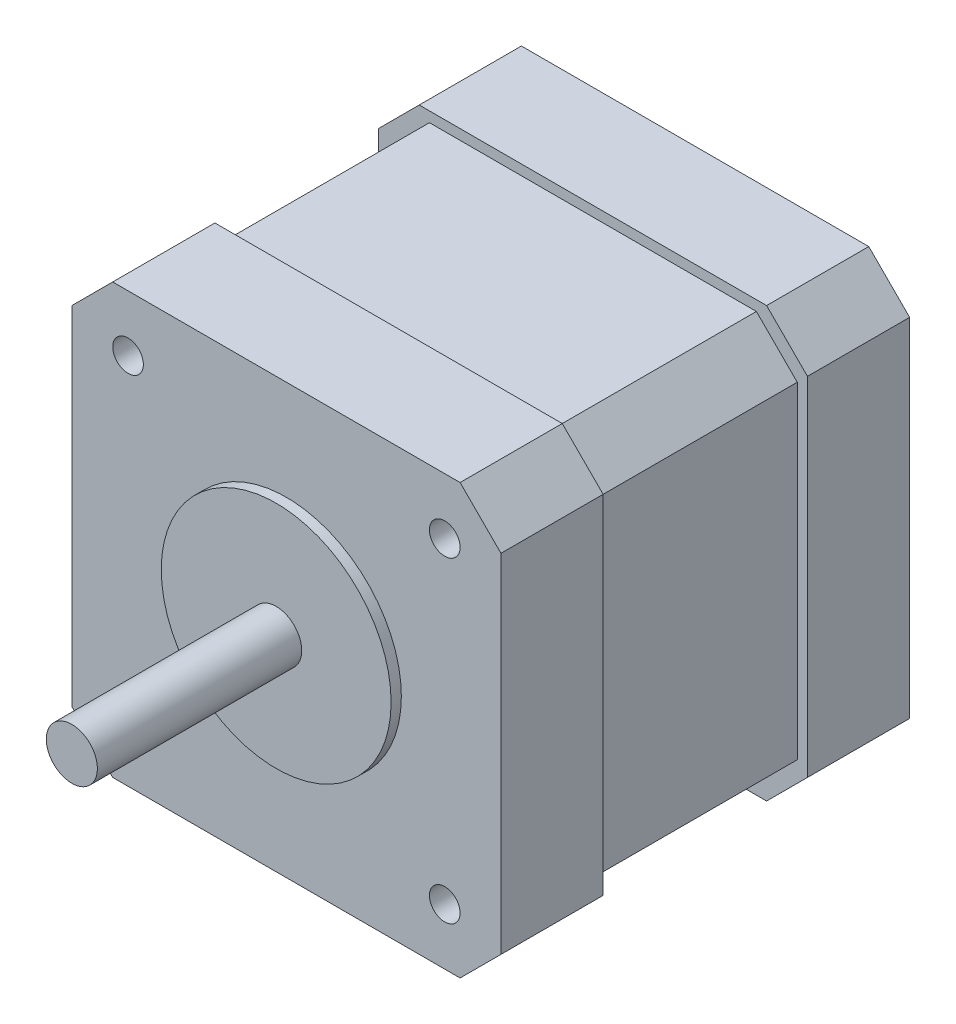
ISO-10303-21;
HEADER;
FILE_DESCRIPTION(('STEP AP214'),'2;1');
FILE_NAME('part.step','',(''),(''),'','','');
FILE_SCHEMA(('AUTOMOTIVE_DESIGN { 1 0 10303 214 1 1 1 1 }'));
ENDSEC;
DATA;
#1=APPLICATION_CONTEXT('core data for automotive mechanical design processes');
#2=APPLICATION_PROTOCOL_DEFINITION('international standard','automotive_design',2000,#1);
#3=PRODUCT_CONTEXT('',#1,'mechanical');
#4=PRODUCT('Part','Part','',(#3));
#5=PRODUCT_RELATED_PRODUCT_CATEGORY('part','',(#4));
#6=PRODUCT_DEFINITION_FORMATION('','',#4);
#7=PRODUCT_DEFINITION_CONTEXT('part definition',#1,'design');
#8=PRODUCT_DEFINITION('design','',#6,#7);
#9=PRODUCT_DEFINITION_SHAPE('','',#8);
#10=(LENGTH_UNIT() NAMED_UNIT(*) SI_UNIT(.MILLI.,.METRE.));
#11=(NAMED_UNIT(*) PLANE_ANGLE_UNIT() SI_UNIT($,.RADIAN.));
#12=(NAMED_UNIT(*) SI_UNIT($,.STERADIAN.) SOLID_ANGLE_UNIT());
#13=UNCERTAINTY_MEASURE_WITH_UNIT(LENGTH_MEASURE(1.E-05),#10,'distance_accuracy_value','');
#14=(GEOMETRIC_REPRESENTATION_CONTEXT(3) GLOBAL_UNCERTAINTY_ASSIGNED_CONTEXT((#13)) GLOBAL_UNIT_ASSIGNED_CONTEXT((#10,
#11,#12)) REPRESENTATION_CONTEXT('',''));
#15=CARTESIAN_POINT('',(0.,0.,0.));
#16=DIRECTION('',(0.,0.,1.));
#17=DIRECTION('',(1.,0.,0.));
#18=AXIS2_PLACEMENT_3D('',#15,#16,#17);
#19=CARTESIAN_POINT('',(0.,0.,10.));
#20=DIRECTION('',(0.,0.,1.));
#21=DIRECTION('',(1.,0.,0.));
#22=AXIS2_PLACEMENT_3D('',#19,#20,#21);
#23=PLANE('',#22);
#24=DIRECTION('',(0.,-1.,0.));
#25=VECTOR('',#24,1.);
#26=CARTESIAN_POINT('',(-21.,21.,10.));
#27=LINE('',#26,#25);
#28=CARTESIAN_POINT('',(-21.,17.,10.));
#29=VERTEX_POINT('',#28);
#30=CARTESIAN_POINT('',(-21.,-17.,10.));
#31=VERTEX_POINT('',#30);
#32=EDGE_CURVE('E286',#29,#31,#27,.T.);
#33=ORIENTED_EDGE('',*,*,#32,.T.);
#34=DIRECTION('',(-0.707106781186546,0.707106781186549,0.));
#35=VECTOR('',#34,1.);
#36=CARTESIAN_POINT('',(-19.,-19.,10.));
#37=LINE('',#36,#35);
#38=CARTESIAN_POINT('',(-17.,-21.,10.));
#39=VERTEX_POINT('',#38);
#40=EDGE_CURVE('E11',#31,#39,#37,.F.);
#41=ORIENTED_EDGE('',*,*,#40,.T.);
#42=DIRECTION('',(1.,0.,0.));
#43=VECTOR('',#42,1.);
#44=CARTESIAN_POINT('',(-21.,-21.,10.));
#45=LINE('',#44,#43);
#46=CARTESIAN_POINT('',(17.,-21.,10.));
#47=VERTEX_POINT('',#46);
#48=EDGE_CURVE('E290',#39,#47,#45,.T.);
#49=ORIENTED_EDGE('',*,*,#48,.T.);
#50=DIRECTION('',(-0.707106781186548,-0.707106781186547,0.));
#51=VECTOR('',#50,1.);
#52=CARTESIAN_POINT('',(19.,-19.,10.));
#53=LINE('',#52,#51);
#54=CARTESIAN_POINT('',(21.,-17.,10.));
#55=VERTEX_POINT('',#54);
#56=EDGE_CURVE('E50',#47,#55,#53,.F.);
#57=ORIENTED_EDGE('',*,*,#56,.T.);
#58=DIRECTION('',(0.,1.,0.));
#59=VECTOR('',#58,1.);
#60=CARTESIAN_POINT('',(21.,21.,10.));
#61=LINE('',#60,#59);
#62=CARTESIAN_POINT('',(21.,17.,10.));
#63=VERTEX_POINT('',#62);
#64=EDGE_CURVE('E279',#55,#63,#61,.T.);
#65=ORIENTED_EDGE('',*,*,#64,.T.);
#66=DIRECTION('',(0.707106781186547,-0.707106781186548,0.));
#67=VECTOR('',#66,1.);
#68=CARTESIAN_POINT('',(19.,19.,10.));
#69=LINE('',#68,#67);
#70=CARTESIAN_POINT('',(17.,21.,10.));
#71=VERTEX_POINT('',#70);
#72=EDGE_CURVE('E64',#63,#71,#69,.F.);
#73=ORIENTED_EDGE('',*,*,#72,.T.);
#74=DIRECTION('',(-1.,0.,0.));
#75=VECTOR('',#74,1.);
#76=CARTESIAN_POINT('',(-21.,21.,10.));
#77=LINE('',#76,#75);
#78=CARTESIAN_POINT('',(-17.,21.,10.));
#79=VERTEX_POINT('',#78);
#80=EDGE_CURVE('E282',#71,#79,#77,.T.);
#81=ORIENTED_EDGE('',*,*,#80,.T.);
#82=DIRECTION('',(0.707106781186548,0.707106781186547,0.));
#83=VECTOR('',#82,1.);
#84=CARTESIAN_POINT('',(-19.,19.,10.));
#85=LINE('',#84,#83);
#86=EDGE_CURVE('E215',#79,#29,#85,.F.);
#87=ORIENTED_EDGE('',*,*,#86,.T.);
#88=EDGE_LOOP('',(#33,#41,#49,#57,#65,#73,#81,#87));
#89=FACE_BOUND('',#88,.T.);
#90=DIRECTION('',(-1.,0.,0.));
#91=VECTOR('',#90,1.);
#92=CARTESIAN_POINT('',(-20.,20.,10.));
#93=LINE('',#92,#91);
#94=CARTESIAN_POINT('',(16.,20.,10.));
#95=VERTEX_POINT('',#94);
#96=CARTESIAN_POINT('',(-16.,20.,10.));
#97=VERTEX_POINT('',#96);
#98=EDGE_CURVE('E268',#95,#97,#93,.T.);
#99=ORIENTED_EDGE('',*,*,#98,.F.);
#100=DIRECTION('',(-0.707106781186546,0.707106781186549,0.));
#101=VECTOR('',#100,1.);
#102=CARTESIAN_POINT('',(16.,20.,10.));
#103=LINE('',#102,#101);
#104=CARTESIAN_POINT('',(20.,16.,10.));
#105=VERTEX_POINT('',#104);
#106=EDGE_CURVE('E419',#95,#105,#103,.F.);
#107=ORIENTED_EDGE('',*,*,#106,.T.);
#108=DIRECTION('',(0.,1.,0.));
#109=VECTOR('',#108,1.);
#110=CARTESIAN_POINT('',(20.,20.,10.));
#111=LINE('',#110,#109);
#112=CARTESIAN_POINT('',(20.,-16.,10.));
#113=VERTEX_POINT('',#112);
#114=EDGE_CURVE('E264',#113,#105,#111,.T.);
#115=ORIENTED_EDGE('',*,*,#114,.F.);
#116=DIRECTION('',(0.707106781186548,0.707106781186547,0.));
#117=VECTOR('',#116,1.);
#118=CARTESIAN_POINT('',(20.,-16.,10.));
#119=LINE('',#118,#117);
#120=CARTESIAN_POINT('',(16.,-20.,10.));
#121=VERTEX_POINT('',#120);
#122=EDGE_CURVE('E413',#113,#121,#119,.F.);
#123=ORIENTED_EDGE('',*,*,#122,.T.);
#124=DIRECTION('',(1.,0.,0.));
#125=VECTOR('',#124,1.);
#126=CARTESIAN_POINT('',(-20.,-20.,10.));
#127=LINE('',#126,#125);
#128=CARTESIAN_POINT('',(-16.,-20.,10.));
#129=VERTEX_POINT('',#128);
#130=EDGE_CURVE('E251',#129,#121,#127,.T.);
#131=ORIENTED_EDGE('',*,*,#130,.F.);
#132=DIRECTION('',(0.707106781186547,-0.707106781186548,0.));
#133=VECTOR('',#132,1.);
#134=CARTESIAN_POINT('',(-16.,-20.,10.));
#135=LINE('',#134,#133);
#136=CARTESIAN_POINT('',(-20.,-16.,10.));
#137=VERTEX_POINT('',#136);
#138=EDGE_CURVE('E407',#129,#137,#135,.F.);
#139=ORIENTED_EDGE('',*,*,#138,.T.);
#140=DIRECTION('',(0.,-1.,0.));
#141=VECTOR('',#140,1.);
#142=CARTESIAN_POINT('',(-20.,20.,10.));
#143=LINE('',#142,#141);
#144=CARTESIAN_POINT('',(-20.,16.,10.));
#145=VERTEX_POINT('',#144);
#146=EDGE_CURVE('E272',#145,#137,#143,.T.);
#147=ORIENTED_EDGE('',*,*,#146,.F.);
#148=DIRECTION('',(-0.707106781186548,-0.707106781186547,0.));
#149=VECTOR('',#148,1.);
#150=CARTESIAN_POINT('',(-20.,16.,10.));
#151=LINE('',#150,#149);
#152=EDGE_CURVE('E425',#145,#97,#151,.F.);
#153=ORIENTED_EDGE('',*,*,#152,.T.);
#154=EDGE_LOOP('',(#99,#107,#115,#123,#131,#139,#147,#153));
#155=FACE_BOUND('',#154,.T.);
#156=ADVANCED_FACE('F41',(#89,#155),#23,.T.);
#157=CARTESIAN_POINT('',(21.,21.,10.));
#158=DIRECTION('',(-1.,0.,0.));
#159=DIRECTION('',(0.,0.,1.));
#160=AXIS2_PLACEMENT_3D('',#157,#158,#159);
#161=PLANE('',#160);
#162=ORIENTED_EDGE('',*,*,#64,.F.);
#163=DIRECTION('',(0.,0.,-1.));
#164=VECTOR('',#163,1.);
#165=CARTESIAN_POINT('',(21.,-17.,10.));
#166=LINE('',#165,#164);
#167=CARTESIAN_POINT('',(21.,-17.,0.));
#168=VERTEX_POINT('',#167);
#169=EDGE_CURVE('E383',#55,#168,#166,.T.);
#170=ORIENTED_EDGE('',*,*,#169,.T.);
#171=DIRECTION('',(0.,1.,0.));
#172=VECTOR('',#171,1.);
#173=CARTESIAN_POINT('',(21.,21.,0.));
#174=LINE('',#173,#172);
#175=CARTESIAN_POINT('',(21.,17.,0.));
#176=VERTEX_POINT('',#175);
#177=EDGE_CURVE('E263',#168,#176,#174,.T.);
#178=ORIENTED_EDGE('',*,*,#177,.T.);
#179=DIRECTION('',(0.,0.,1.));
#180=VECTOR('',#179,1.);
#181=CARTESIAN_POINT('',(21.,17.,10.));
#182=LINE('',#181,#180);
#183=EDGE_CURVE('E380',#176,#63,#182,.T.);
#184=ORIENTED_EDGE('',*,*,#183,.T.);
#185=EDGE_LOOP('',(#162,#170,#178,#184));
#186=FACE_BOUND('',#185,.T.);
#187=ADVANCED_FACE('F451',(#186),#161,.F.);
#188=CARTESIAN_POINT('',(-21.,21.,10.));
#189=DIRECTION('',(0.,-1.,0.));
#190=DIRECTION('',(0.,0.,-1.));
#191=AXIS2_PLACEMENT_3D('',#188,#189,#190);
#192=PLANE('',#191);
#193=ORIENTED_EDGE('',*,*,#80,.F.);
#194=DIRECTION('',(0.,0.,-1.));
#195=VECTOR('',#194,1.);
#196=CARTESIAN_POINT('',(17.,21.,10.));
#197=LINE('',#196,#195);
#198=CARTESIAN_POINT('',(17.,21.,0.));
#199=VERTEX_POINT('',#198);
#200=EDGE_CURVE('E403',#71,#199,#197,.T.);
#201=ORIENTED_EDGE('',*,*,#200,.T.);
#202=DIRECTION('',(-1.,0.,0.));
#203=VECTOR('',#202,1.);
#204=CARTESIAN_POINT('',(-21.,21.,0.));
#205=LINE('',#204,#203);
#206=CARTESIAN_POINT('',(-17.,21.,0.));
#207=VERTEX_POINT('',#206);
#208=EDGE_CURVE('E297',#199,#207,#205,.T.);
#209=ORIENTED_EDGE('',*,*,#208,.T.);
#210=DIRECTION('',(0.,0.,1.));
#211=VECTOR('',#210,1.);
#212=CARTESIAN_POINT('',(-17.,21.,10.));
#213=LINE('',#212,#211);
#214=EDGE_CURVE('E57',#207,#79,#213,.T.);
#215=ORIENTED_EDGE('',*,*,#214,.T.);
#216=EDGE_LOOP('',(#193,#201,#209,#215));
#217=FACE_BOUND('',#216,.T.);
#218=ADVANCED_FACE('F473',(#217),#192,.F.);
#219=CARTESIAN_POINT('',(-21.,21.,10.));
#220=DIRECTION('',(1.,0.,0.));
#221=DIRECTION('',(0.,1.,0.));
#222=AXIS2_PLACEMENT_3D('',#219,#220,#221);
#223=PLANE('',#222);
#224=DIRECTION('',(0.,-1.,0.));
#225=VECTOR('',#224,1.);
#226=CARTESIAN_POINT('',(-21.,21.,0.));
#227=LINE('',#226,#225);
#228=CARTESIAN_POINT('',(-21.,17.,0.));
#229=VERTEX_POINT('',#228);
#230=CARTESIAN_POINT('',(-21.,-17.,0.));
#231=VERTEX_POINT('',#230);
#232=EDGE_CURVE('E300',#229,#231,#227,.T.);
#233=ORIENTED_EDGE('',*,*,#232,.T.);
#234=DIRECTION('',(0.,0.,1.));
#235=VECTOR('',#234,1.);
#236=CARTESIAN_POINT('',(-21.,-17.,10.));
#237=LINE('',#236,#235);
#238=EDGE_CURVE('E363',#231,#31,#237,.T.);
#239=ORIENTED_EDGE('',*,*,#238,.T.);
#240=ORIENTED_EDGE('',*,*,#32,.F.);
#241=DIRECTION('',(0.,0.,-1.));
#242=VECTOR('',#241,1.);
#243=CARTESIAN_POINT('',(-21.,17.,10.));
#244=LINE('',#243,#242);
#245=EDGE_CURVE('E359',#29,#229,#244,.T.);
#246=ORIENTED_EDGE('',*,*,#245,.T.);
#247=EDGE_LOOP('',(#233,#239,#240,#246));
#248=FACE_BOUND('',#247,.T.);
#249=ADVANCED_FACE('F467',(#248),#223,.F.);
#250=CARTESIAN_POINT('',(-21.,-21.,10.));
#251=DIRECTION('',(0.,1.,0.));
#252=DIRECTION('',(0.,0.,1.));
#253=AXIS2_PLACEMENT_3D('',#250,#251,#252);
#254=PLANE('',#253);
#255=ORIENTED_EDGE('',*,*,#48,.F.);
#256=DIRECTION('',(0.,0.,-1.));
#257=VECTOR('',#256,1.);
#258=CARTESIAN_POINT('',(-17.,-21.,10.));
#259=LINE('',#258,#257);
#260=CARTESIAN_POINT('',(-17.,-21.,0.));
#261=VERTEX_POINT('',#260);
#262=EDGE_CURVE('E343',#39,#261,#259,.T.);
#263=ORIENTED_EDGE('',*,*,#262,.T.);
#264=DIRECTION('',(1.,0.,0.));
#265=VECTOR('',#264,1.);
#266=CARTESIAN_POINT('',(-21.,-21.,0.));
#267=LINE('',#266,#265);
#268=CARTESIAN_POINT('',(17.,-21.,0.));
#269=VERTEX_POINT('',#268);
#270=EDGE_CURVE('E283',#261,#269,#267,.T.);
#271=ORIENTED_EDGE('',*,*,#270,.T.);
#272=DIRECTION('',(0.,0.,1.));
#273=VECTOR('',#272,1.);
#274=CARTESIAN_POINT('',(17.,-21.,10.));
#275=LINE('',#274,#273);
#276=EDGE_CURVE('E340',#269,#47,#275,.T.);
#277=ORIENTED_EDGE('',*,*,#276,.T.);
#278=EDGE_LOOP('',(#255,#263,#271,#277));
#279=FACE_BOUND('',#278,.T.);
#280=ADVANCED_FACE('F459',(#279),#254,.F.);
#281=CARTESIAN_POINT('',(0.,0.,0.));
#282=DIRECTION('',(0.,0.,1.));
#283=DIRECTION('',(1.,0.,0.));
#284=AXIS2_PLACEMENT_3D('',#281,#282,#283);
#285=PLANE('',#284);
#286=CARTESIAN_POINT('',(15.5,-15.5,0.));
#287=DIRECTION('',(0.,0.,1.));
#288=DIRECTION('',(1.,0.,0.));
#289=AXIS2_PLACEMENT_3D('',#286,#287,#288);
#290=CIRCLE('',#289,1.5);
#291=CARTESIAN_POINT('',(17.,-15.5,0.));
#292=VERTEX_POINT('',#291);
#293=EDGE_CURVE('E657',#292,#292,#290,.T.);
#294=ORIENTED_EDGE('',*,*,#293,.T.);
#295=EDGE_LOOP('',(#294));
#296=FACE_BOUND('',#295,.T.);
#297=CARTESIAN_POINT('',(15.5,15.5,0.));
#298=DIRECTION('',(0.,0.,1.));
#299=DIRECTION('',(1.,0.,0.));
#300=AXIS2_PLACEMENT_3D('',#297,#298,#299);
#301=CIRCLE('',#300,1.5);
#302=CARTESIAN_POINT('',(17.,15.5,0.));
#303=VERTEX_POINT('',#302);
#304=EDGE_CURVE('E667',#303,#303,#301,.T.);
#305=ORIENTED_EDGE('',*,*,#304,.T.);
#306=EDGE_LOOP('',(#305));
#307=FACE_BOUND('',#306,.T.);
#308=CARTESIAN_POINT('',(-15.5,15.5,0.));
#309=DIRECTION('',(0.,0.,1.));
#310=DIRECTION('',(1.,0.,0.));
#311=AXIS2_PLACEMENT_3D('',#308,#309,#310);
#312=CIRCLE('',#311,1.5);
#313=CARTESIAN_POINT('',(-14.,15.5,0.));
#314=VERTEX_POINT('',#313);
#315=EDGE_CURVE('E675',#314,#314,#312,.T.);
#316=ORIENTED_EDGE('',*,*,#315,.T.);
#317=EDGE_LOOP('',(#316));
#318=FACE_BOUND('',#317,.T.);
#319=CARTESIAN_POINT('',(-15.5,-15.5,0.));
#320=DIRECTION('',(0.,0.,1.));
#321=DIRECTION('',(1.,0.,0.));
#322=AXIS2_PLACEMENT_3D('',#319,#320,#321);
#323=CIRCLE('',#322,1.5);
#324=CARTESIAN_POINT('',(-14.,-15.5,0.));
#325=VERTEX_POINT('',#324);
#326=EDGE_CURVE('E683',#325,#325,#323,.T.);
#327=ORIENTED_EDGE('',*,*,#326,.T.);
#328=EDGE_LOOP('',(#327));
#329=FACE_BOUND('',#328,.T.);
#330=ORIENTED_EDGE('',*,*,#270,.F.);
#331=DIRECTION('',(0.707106781186546,-0.707106781186549,0.));
#332=VECTOR('',#331,1.);
#333=CARTESIAN_POINT('',(-17.,-21.,0.));
#334=LINE('',#333,#332);
#335=EDGE_CURVE('E356',#261,#231,#334,.F.);
#336=ORIENTED_EDGE('',*,*,#335,.T.);
#337=ORIENTED_EDGE('',*,*,#232,.F.);
#338=DIRECTION('',(-0.707106781186548,-0.707106781186547,0.));
#339=VECTOR('',#338,1.);
#340=CARTESIAN_POINT('',(-21.,17.,0.));
#341=LINE('',#340,#339);
#342=EDGE_CURVE('E347',#229,#207,#341,.F.);
#343=ORIENTED_EDGE('',*,*,#342,.T.);
#344=ORIENTED_EDGE('',*,*,#208,.F.);
#345=DIRECTION('',(-0.707106781186547,0.707106781186548,0.));
#346=VECTOR('',#345,1.);
#347=CARTESIAN_POINT('',(17.,21.,0.));
#348=LINE('',#347,#346);
#349=EDGE_CURVE('E350',#199,#176,#348,.F.);
#350=ORIENTED_EDGE('',*,*,#349,.T.);
#351=ORIENTED_EDGE('',*,*,#177,.F.);
#352=DIRECTION('',(0.707106781186548,0.707106781186547,0.));
#353=VECTOR('',#352,1.);
#354=CARTESIAN_POINT('',(21.,-17.,0.));
#355=LINE('',#354,#353);
#356=EDGE_CURVE('E353',#168,#269,#355,.F.);
#357=ORIENTED_EDGE('',*,*,#356,.T.);
#358=EDGE_LOOP('',(#330,#336,#337,#343,#344,#350,#351,#357));
#359=FACE_BOUND('',#358,.T.);
#360=ADVANCED_FACE('F457',(#296,#307,#318,#329,#359),#285,.F.);
#361=CARTESIAN_POINT('',(20.,20.,30.));
#362=DIRECTION('',(-1.,0.,0.));
#363=DIRECTION('',(0.,-1.,0.));
#364=AXIS2_PLACEMENT_3D('',#361,#362,#363);
#365=PLANE('',#364);
#366=DIRECTION('',(0.,1.,0.));
#367=VECTOR('',#366,1.);
#368=CARTESIAN_POINT('',(20.,20.,30.));
#369=LINE('',#368,#367);
#370=CARTESIAN_POINT('',(20.,-16.,30.));
#371=VERTEX_POINT('',#370);
#372=CARTESIAN_POINT('',(20.,16.,30.));
#373=VERTEX_POINT('',#372);
#374=EDGE_CURVE('E246',#371,#373,#369,.T.);
#375=ORIENTED_EDGE('',*,*,#374,.F.);
#376=DIRECTION('',(0.,0.,-1.));
#377=VECTOR('',#376,1.);
#378=CARTESIAN_POINT('',(20.,-16.,30.));
#379=LINE('',#378,#377);
#380=EDGE_CURVE('E376',#371,#113,#379,.T.);
#381=ORIENTED_EDGE('',*,*,#380,.T.);
#382=ORIENTED_EDGE('',*,*,#114,.T.);
#383=DIRECTION('',(0.,0.,1.));
#384=VECTOR('',#383,1.);
#385=CARTESIAN_POINT('',(20.,16.,30.));
#386=LINE('',#385,#384);
#387=EDGE_CURVE('E373',#105,#373,#386,.T.);
#388=ORIENTED_EDGE('',*,*,#387,.T.);
#389=EDGE_LOOP('',(#375,#381,#382,#388));
#390=FACE_BOUND('',#389,.T.);
#391=ADVANCED_FACE('F499',(#390),#365,.F.);
#392=CARTESIAN_POINT('',(-20.,20.,30.));
#393=DIRECTION('',(0.,-1.,0.));
#394=DIRECTION('',(0.,0.,-1.));
#395=AXIS2_PLACEMENT_3D('',#392,#393,#394);
#396=PLANE('',#395);
#397=DIRECTION('',(-1.,0.,0.));
#398=VECTOR('',#397,1.);
#399=CARTESIAN_POINT('',(-20.,20.,30.));
#400=LINE('',#399,#398);
#401=CARTESIAN_POINT('',(16.,20.,30.));
#402=VERTEX_POINT('',#401);
#403=CARTESIAN_POINT('',(-16.,20.,30.));
#404=VERTEX_POINT('',#403);
#405=EDGE_CURVE('E250',#402,#404,#400,.T.);
#406=ORIENTED_EDGE('',*,*,#405,.F.);
#407=DIRECTION('',(0.,0.,-1.));
#408=VECTOR('',#407,1.);
#409=CARTESIAN_POINT('',(16.,20.,30.));
#410=LINE('',#409,#408);
#411=EDGE_CURVE('E397',#402,#95,#410,.T.);
#412=ORIENTED_EDGE('',*,*,#411,.T.);
#413=ORIENTED_EDGE('',*,*,#98,.T.);
#414=DIRECTION('',(0.,0.,1.));
#415=VECTOR('',#414,1.);
#416=CARTESIAN_POINT('',(-16.,20.,30.));
#417=LINE('',#416,#415);
#418=EDGE_CURVE('E394',#97,#404,#417,.T.);
#419=ORIENTED_EDGE('',*,*,#418,.T.);
#420=EDGE_LOOP('',(#406,#412,#413,#419));
#421=FACE_BOUND('',#420,.T.);
#422=ADVANCED_FACE('F586',(#421),#396,.F.);
#423=CARTESIAN_POINT('',(-20.,20.,30.));
#424=DIRECTION('',(1.,0.,0.));
#425=DIRECTION('',(0.,1.,0.));
#426=AXIS2_PLACEMENT_3D('',#423,#424,#425);
#427=PLANE('',#426);
#428=ORIENTED_EDGE('',*,*,#146,.T.);
#429=DIRECTION('',(0.,0.,1.));
#430=VECTOR('',#429,1.);
#431=CARTESIAN_POINT('',(-20.,-16.,30.));
#432=LINE('',#431,#430);
#433=CARTESIAN_POINT('',(-20.,-16.,30.));
#434=VERTEX_POINT('',#433);
#435=EDGE_CURVE('E337',#137,#434,#432,.T.);
#436=ORIENTED_EDGE('',*,*,#435,.T.);
#437=DIRECTION('',(0.,-1.,0.));
#438=VECTOR('',#437,1.);
#439=CARTESIAN_POINT('',(-20.,20.,30.));
#440=LINE('',#439,#438);
#441=CARTESIAN_POINT('',(-20.,16.,30.));
#442=VERTEX_POINT('',#441);
#443=EDGE_CURVE('E255',#442,#434,#440,.T.);
#444=ORIENTED_EDGE('',*,*,#443,.F.);
#445=DIRECTION('',(0.,0.,-1.));
#446=VECTOR('',#445,1.);
#447=CARTESIAN_POINT('',(-20.,16.,30.));
#448=LINE('',#447,#446);
#449=EDGE_CURVE('E333',#442,#145,#448,.T.);
#450=ORIENTED_EDGE('',*,*,#449,.T.);
#451=EDGE_LOOP('',(#428,#436,#444,#450));
#452=FACE_BOUND('',#451,.T.);
#453=ADVANCED_FACE('F583',(#452),#427,.F.);
#454=CARTESIAN_POINT('',(-20.,-20.,30.));
#455=DIRECTION('',(0.,1.,0.));
#456=DIRECTION('',(0.,0.,1.));
#457=AXIS2_PLACEMENT_3D('',#454,#455,#456);
#458=PLANE('',#457);
#459=DIRECTION('',(1.,0.,0.));
#460=VECTOR('',#459,1.);
#461=CARTESIAN_POINT('',(-20.,-20.,30.));
#462=LINE('',#461,#460);
#463=CARTESIAN_POINT('',(-16.,-20.,30.));
#464=VERTEX_POINT('',#463);
#465=CARTESIAN_POINT('',(16.,-20.,30.));
#466=VERTEX_POINT('',#465);
#467=EDGE_CURVE('E259',#464,#466,#462,.T.);
#468=ORIENTED_EDGE('',*,*,#467,.F.);
#469=DIRECTION('',(0.,0.,-1.));
#470=VECTOR('',#469,1.);
#471=CARTESIAN_POINT('',(-16.,-20.,30.));
#472=LINE('',#471,#470);
#473=EDGE_CURVE('E329',#464,#129,#472,.T.);
#474=ORIENTED_EDGE('',*,*,#473,.T.);
#475=ORIENTED_EDGE('',*,*,#130,.T.);
#476=DIRECTION('',(0.,0.,1.));
#477=VECTOR('',#476,1.);
#478=CARTESIAN_POINT('',(16.,-20.,30.));
#479=LINE('',#478,#477);
#480=EDGE_CURVE('E326',#121,#466,#479,.T.);
#481=ORIENTED_EDGE('',*,*,#480,.T.);
#482=EDGE_LOOP('',(#468,#474,#475,#481));
#483=FACE_BOUND('',#482,.T.);
#484=ADVANCED_FACE('F580',(#483),#458,.F.);
#485=CARTESIAN_POINT('',(0.,0.,30.));
#486=DIRECTION('',(0.,0.,1.));
#487=DIRECTION('',(1.,0.,0.));
#488=AXIS2_PLACEMENT_3D('',#485,#486,#487);
#489=PLANE('',#488);
#490=DIRECTION('',(1.,0.,0.));
#491=VECTOR('',#490,1.);
#492=CARTESIAN_POINT('',(-21.,-21.,30.));
#493=LINE('',#492,#491);
#494=CARTESIAN_POINT('',(-17.,-21.,30.));
#495=VERTEX_POINT('',#494);
#496=CARTESIAN_POINT('',(17.,-21.,30.));
#497=VERTEX_POINT('',#496);
#498=EDGE_CURVE('E222',#495,#497,#493,.T.);
#499=ORIENTED_EDGE('',*,*,#498,.F.);
#500=DIRECTION('',(0.707106781186546,-0.707106781186549,0.));
#501=VECTOR('',#500,1.);
#502=CARTESIAN_POINT('',(-17.,-21.,30.));
#503=LINE('',#502,#501);
#504=CARTESIAN_POINT('',(-21.,-17.,30.));
#505=VERTEX_POINT('',#504);
#506=EDGE_CURVE('E204',#495,#505,#503,.F.);
#507=ORIENTED_EDGE('',*,*,#506,.T.);
#508=DIRECTION('',(0.,-1.,0.));
#509=VECTOR('',#508,1.);
#510=CARTESIAN_POINT('',(-21.,21.,30.));
#511=LINE('',#510,#509);
#512=CARTESIAN_POINT('',(-21.,17.,30.));
#513=VERTEX_POINT('',#512);
#514=EDGE_CURVE('E235',#513,#505,#511,.T.);
#515=ORIENTED_EDGE('',*,*,#514,.F.);
#516=DIRECTION('',(-0.707106781186549,-0.707106781186546,0.));
#517=VECTOR('',#516,1.);
#518=CARTESIAN_POINT('',(-21.,17.,30.));
#519=LINE('',#518,#517);
#520=CARTESIAN_POINT('',(-17.,21.,30.));
#521=VERTEX_POINT('',#520);
#522=EDGE_CURVE('E431',#513,#521,#519,.F.);
#523=ORIENTED_EDGE('',*,*,#522,.T.);
#524=DIRECTION('',(-1.,0.,0.));
#525=VECTOR('',#524,1.);
#526=CARTESIAN_POINT('',(-21.,21.,30.));
#527=LINE('',#526,#525);
#528=CARTESIAN_POINT('',(17.,21.,30.));
#529=VERTEX_POINT('',#528);
#530=EDGE_CURVE('E242',#529,#521,#527,.T.);
#531=ORIENTED_EDGE('',*,*,#530,.F.);
#532=DIRECTION('',(-0.707106781186547,0.707106781186548,0.));
#533=VECTOR('',#532,1.);
#534=CARTESIAN_POINT('',(17.,21.,30.));
#535=LINE('',#534,#533);
#536=CARTESIAN_POINT('',(21.,17.,30.));
#537=VERTEX_POINT('',#536);
#538=EDGE_CURVE('E434',#529,#537,#535,.F.);
#539=ORIENTED_EDGE('',*,*,#538,.T.);
#540=DIRECTION('',(0.,1.,0.));
#541=VECTOR('',#540,1.);
#542=CARTESIAN_POINT('',(21.,21.,30.));
#543=LINE('',#542,#541);
#544=CARTESIAN_POINT('',(21.,-17.,30.));
#545=VERTEX_POINT('',#544);
#546=EDGE_CURVE('E557',#545,#537,#543,.T.);
#547=ORIENTED_EDGE('',*,*,#546,.F.);
#548=DIRECTION('',(0.707106781186548,0.707106781186547,0.));
#549=VECTOR('',#548,1.);
#550=CARTESIAN_POINT('',(21.,-17.,30.));
#551=LINE('',#550,#549);
#552=EDGE_CURVE('E216',#545,#497,#551,.F.);
#553=ORIENTED_EDGE('',*,*,#552,.T.);
#554=EDGE_LOOP('',(#499,#507,#515,#523,#531,#539,#547,#553));
#555=FACE_BOUND('',#554,.T.);
#556=ORIENTED_EDGE('',*,*,#443,.T.);
#557=DIRECTION('',(-0.707106781186547,0.707106781186548,0.));
#558=VECTOR('',#557,1.);
#559=CARTESIAN_POINT('',(-18.,-18.,30.));
#560=LINE('',#559,#558);
#561=EDGE_CURVE('E410',#434,#464,#560,.F.);
#562=ORIENTED_EDGE('',*,*,#561,.T.);
#563=ORIENTED_EDGE('',*,*,#467,.T.);
#564=DIRECTION('',(-0.707106781186548,-0.707106781186547,0.));
#565=VECTOR('',#564,1.);
#566=CARTESIAN_POINT('',(18.,-18.,30.));
#567=LINE('',#566,#565);
#568=EDGE_CURVE('E416',#466,#371,#567,.F.);
#569=ORIENTED_EDGE('',*,*,#568,.T.);
#570=ORIENTED_EDGE('',*,*,#374,.T.);
#571=DIRECTION('',(0.707106781186546,-0.707106781186549,0.));
#572=VECTOR('',#571,1.);
#573=CARTESIAN_POINT('',(18.,18.,30.));
#574=LINE('',#573,#572);
#575=EDGE_CURVE('E422',#373,#402,#574,.F.);
#576=ORIENTED_EDGE('',*,*,#575,.T.);
#577=ORIENTED_EDGE('',*,*,#405,.T.);
#578=DIRECTION('',(0.707106781186548,0.707106781186547,0.));
#579=VECTOR('',#578,1.);
#580=CARTESIAN_POINT('',(-18.,18.,30.));
#581=LINE('',#580,#579);
#582=EDGE_CURVE('E428',#404,#442,#581,.F.);
#583=ORIENTED_EDGE('',*,*,#582,.T.);
#584=EDGE_LOOP('',(#556,#562,#563,#569,#570,#576,#577,#583));
#585=FACE_BOUND('',#584,.T.);
#586=ADVANCED_FACE('F230',(#555,#585),#489,.F.);
#587=CARTESIAN_POINT('',(21.,21.,40.));
#588=DIRECTION('',(-1.,0.,0.));
#589=DIRECTION('',(0.,0.,1.));
#590=AXIS2_PLACEMENT_3D('',#587,#588,#589);
#591=PLANE('',#590);
#592=DIRECTION('',(0.,1.,0.));
#593=VECTOR('',#592,1.);
#594=CARTESIAN_POINT('',(21.,21.,40.));
#595=LINE('',#594,#593);
#596=CARTESIAN_POINT('',(21.,-17.,40.));
#597=VERTEX_POINT('',#596);
#598=CARTESIAN_POINT('',(21.,17.,40.));
#599=VERTEX_POINT('',#598);
#600=EDGE_CURVE('E234',#597,#599,#595,.T.);
#601=ORIENTED_EDGE('',*,*,#600,.F.);
#602=DIRECTION('',(0.,0.,-1.));
#603=VECTOR('',#602,1.);
#604=CARTESIAN_POINT('',(21.,-17.,40.));
#605=LINE('',#604,#603);
#606=EDGE_CURVE('E369',#597,#545,#605,.T.);
#607=ORIENTED_EDGE('',*,*,#606,.T.);
#608=ORIENTED_EDGE('',*,*,#546,.T.);
#609=DIRECTION('',(0.,0.,1.));
#610=VECTOR('',#609,1.);
#611=CARTESIAN_POINT('',(21.,17.,40.));
#612=LINE('',#611,#610);
#613=EDGE_CURVE('E366',#537,#599,#612,.T.);
#614=ORIENTED_EDGE('',*,*,#613,.T.);
#615=EDGE_LOOP('',(#601,#607,#608,#614));
#616=FACE_BOUND('',#615,.T.);
#617=ADVANCED_FACE('F573',(#616),#591,.F.);
#618=CARTESIAN_POINT('',(-21.,21.,40.));
#619=DIRECTION('',(0.,-1.,0.));
#620=DIRECTION('',(0.,0.,-1.));
#621=AXIS2_PLACEMENT_3D('',#618,#619,#620);
#622=PLANE('',#621);
#623=DIRECTION('',(-1.,0.,0.));
#624=VECTOR('',#623,1.);
#625=CARTESIAN_POINT('',(-21.,21.,40.));
#626=LINE('',#625,#624);
#627=CARTESIAN_POINT('',(17.,21.,40.));
#628=VERTEX_POINT('',#627);
#629=CARTESIAN_POINT('',(-17.,21.,40.));
#630=VERTEX_POINT('',#629);
#631=EDGE_CURVE('E240',#628,#630,#626,.T.);
#632=ORIENTED_EDGE('',*,*,#631,.F.);
#633=DIRECTION('',(0.,0.,-1.));
#634=VECTOR('',#633,1.);
#635=CARTESIAN_POINT('',(17.,21.,40.));
#636=LINE('',#635,#634);
#637=EDGE_CURVE('E390',#628,#529,#636,.T.);
#638=ORIENTED_EDGE('',*,*,#637,.T.);
#639=ORIENTED_EDGE('',*,*,#530,.T.);
#640=DIRECTION('',(0.,0.,1.));
#641=VECTOR('',#640,1.);
#642=CARTESIAN_POINT('',(-17.,21.,40.));
#643=LINE('',#642,#641);
#644=EDGE_CURVE('E387',#521,#630,#643,.T.);
#645=ORIENTED_EDGE('',*,*,#644,.T.);
#646=EDGE_LOOP('',(#632,#638,#639,#645));
#647=FACE_BOUND('',#646,.T.);
#648=ADVANCED_FACE('F544',(#647),#622,.F.);
#649=CARTESIAN_POINT('',(-21.,21.,40.));
#650=DIRECTION('',(1.,0.,0.));
#651=DIRECTION('',(0.,1.,0.));
#652=AXIS2_PLACEMENT_3D('',#649,#650,#651);
#653=PLANE('',#652);
#654=ORIENTED_EDGE('',*,*,#514,.T.);
#655=DIRECTION('',(0.,0.,1.));
#656=VECTOR('',#655,1.);
#657=CARTESIAN_POINT('',(-21.,-17.,40.));
#658=LINE('',#657,#656);
#659=CARTESIAN_POINT('',(-21.,-17.,40.));
#660=VERTEX_POINT('',#659);
#661=EDGE_CURVE('E209',#505,#660,#658,.T.);
#662=ORIENTED_EDGE('',*,*,#661,.T.);
#663=DIRECTION('',(0.,-1.,0.));
#664=VECTOR('',#663,1.);
#665=CARTESIAN_POINT('',(-21.,21.,40.));
#666=LINE('',#665,#664);
#667=CARTESIAN_POINT('',(-21.,17.,40.));
#668=VERTEX_POINT('',#667);
#669=EDGE_CURVE('E549',#668,#660,#666,.T.);
#670=ORIENTED_EDGE('',*,*,#669,.F.);
#671=DIRECTION('',(0.,0.,-1.));
#672=VECTOR('',#671,1.);
#673=CARTESIAN_POINT('',(-21.,17.,40.));
#674=LINE('',#673,#672);
#675=EDGE_CURVE('E227',#668,#513,#674,.T.);
#676=ORIENTED_EDGE('',*,*,#675,.T.);
#677=EDGE_LOOP('',(#654,#662,#670,#676));
#678=FACE_BOUND('',#677,.T.);
#679=ADVANCED_FACE('F565',(#678),#653,.F.);
#680=CARTESIAN_POINT('',(-21.,-21.,40.));
#681=DIRECTION('',(0.,1.,0.));
#682=DIRECTION('',(0.,0.,1.));
#683=AXIS2_PLACEMENT_3D('',#680,#681,#682);
#684=PLANE('',#683);
#685=DIRECTION('',(1.,0.,0.));
#686=VECTOR('',#685,1.);
#687=CARTESIAN_POINT('',(-21.,-21.,40.));
#688=LINE('',#687,#686);
#689=CARTESIAN_POINT('',(-17.,-21.,40.));
#690=VERTEX_POINT('',#689);
#691=CARTESIAN_POINT('',(17.,-21.,40.));
#692=VERTEX_POINT('',#691);
#693=EDGE_CURVE('E225',#690,#692,#688,.T.);
#694=ORIENTED_EDGE('',*,*,#693,.F.);
#695=DIRECTION('',(0.,0.,-1.));
#696=VECTOR('',#695,1.);
#697=CARTESIAN_POINT('',(-17.,-21.,40.));
#698=LINE('',#697,#696);
#699=EDGE_CURVE('E208',#690,#495,#698,.T.);
#700=ORIENTED_EDGE('',*,*,#699,.T.);
#701=ORIENTED_EDGE('',*,*,#498,.T.);
#702=DIRECTION('',(0.,0.,1.));
#703=VECTOR('',#702,1.);
#704=CARTESIAN_POINT('',(17.,-21.,40.));
#705=LINE('',#704,#703);
#706=EDGE_CURVE('E228',#497,#692,#705,.T.);
#707=ORIENTED_EDGE('',*,*,#706,.T.);
#708=EDGE_LOOP('',(#694,#700,#701,#707));
#709=FACE_BOUND('',#708,.T.);
#710=ADVANCED_FACE('F221',(#709),#684,.F.);
#711=CARTESIAN_POINT('',(0.,0.,40.));
#712=DIRECTION('',(0.,0.,1.));
#713=DIRECTION('',(1.,0.,0.));
#714=AXIS2_PLACEMENT_3D('',#711,#712,#713);
#715=PLANE('',#714);
#716=CARTESIAN_POINT('',(15.5,-15.5,40.));
#717=DIRECTION('',(0.,0.,1.));
#718=DIRECTION('',(1.,0.,0.));
#719=AXIS2_PLACEMENT_3D('',#716,#717,#718);
#720=CIRCLE('',#719,1.5);
#721=CARTESIAN_POINT('',(17.,-15.5,40.));
#722=VERTEX_POINT('',#721);
#723=EDGE_CURVE('E660',#722,#722,#720,.T.);
#724=ORIENTED_EDGE('',*,*,#723,.F.);
#725=EDGE_LOOP('',(#724));
#726=FACE_BOUND('',#725,.T.);
#727=CARTESIAN_POINT('',(15.5,15.5,40.));
#728=DIRECTION('',(0.,0.,1.));
#729=DIRECTION('',(1.,0.,0.));
#730=AXIS2_PLACEMENT_3D('',#727,#728,#729);
#731=CIRCLE('',#730,1.5);
#732=CARTESIAN_POINT('',(17.,15.5,40.));
#733=VERTEX_POINT('',#732);
#734=EDGE_CURVE('E664',#733,#733,#731,.T.);
#735=ORIENTED_EDGE('',*,*,#734,.F.);
#736=EDGE_LOOP('',(#735));
#737=FACE_BOUND('',#736,.T.);
#738=CARTESIAN_POINT('',(-15.5,15.5,40.));
#739=DIRECTION('',(0.,0.,1.));
#740=DIRECTION('',(1.,0.,0.));
#741=AXIS2_PLACEMENT_3D('',#738,#739,#740);
#742=CIRCLE('',#741,1.5);
#743=CARTESIAN_POINT('',(-14.,15.5,40.));
#744=VERTEX_POINT('',#743);
#745=EDGE_CURVE('E671',#744,#744,#742,.T.);
#746=ORIENTED_EDGE('',*,*,#745,.F.);
#747=EDGE_LOOP('',(#746));
#748=FACE_BOUND('',#747,.T.);
#749=CARTESIAN_POINT('',(-15.5,-15.5,40.));
#750=DIRECTION('',(0.,0.,1.));
#751=DIRECTION('',(1.,0.,0.));
#752=AXIS2_PLACEMENT_3D('',#749,#750,#751);
#753=CIRCLE('',#752,1.5);
#754=CARTESIAN_POINT('',(-14.,-15.5,40.));
#755=VERTEX_POINT('',#754);
#756=EDGE_CURVE('E679',#755,#755,#753,.T.);
#757=ORIENTED_EDGE('',*,*,#756,.F.);
#758=EDGE_LOOP('',(#757));
#759=FACE_BOUND('',#758,.T.);
#760=CARTESIAN_POINT('',(0.,0.,40.));
#761=DIRECTION('',(0.,0.,1.));
#762=DIRECTION('',(1.,0.,0.));
#763=AXIS2_PLACEMENT_3D('',#760,#761,#762);
#764=CIRCLE('',#763,11.25);
#765=CARTESIAN_POINT('',(11.25,0.,40.));
#766=VERTEX_POINT('',#765);
#767=EDGE_CURVE('E695',#766,#766,#764,.T.);
#768=ORIENTED_EDGE('',*,*,#767,.F.);
#769=EDGE_LOOP('',(#768));
#770=FACE_BOUND('',#769,.T.);
#771=ORIENTED_EDGE('',*,*,#669,.T.);
#772=DIRECTION('',(-0.707106781186546,0.707106781186549,0.));
#773=VECTOR('',#772,1.);
#774=CARTESIAN_POINT('',(-19.,-19.,40.));
#775=LINE('',#774,#773);
#776=EDGE_CURVE('E323',#660,#690,#775,.F.);
#777=ORIENTED_EDGE('',*,*,#776,.T.);
#778=ORIENTED_EDGE('',*,*,#693,.T.);
#779=DIRECTION('',(-0.707106781186548,-0.707106781186547,0.));
#780=VECTOR('',#779,1.);
#781=CARTESIAN_POINT('',(19.,-19.,40.));
#782=LINE('',#781,#780);
#783=EDGE_CURVE('E320',#692,#597,#782,.F.);
#784=ORIENTED_EDGE('',*,*,#783,.T.);
#785=ORIENTED_EDGE('',*,*,#600,.T.);
#786=DIRECTION('',(0.707106781186547,-0.707106781186548,0.));
#787=VECTOR('',#786,1.);
#788=CARTESIAN_POINT('',(19.,19.,40.));
#789=LINE('',#788,#787);
#790=EDGE_CURVE('E317',#599,#628,#789,.F.);
#791=ORIENTED_EDGE('',*,*,#790,.T.);
#792=ORIENTED_EDGE('',*,*,#631,.T.);
#793=DIRECTION('',(0.707106781186549,0.707106781186546,0.));
#794=VECTOR('',#793,1.);
#795=CARTESIAN_POINT('',(-19.,19.,40.));
#796=LINE('',#795,#794);
#797=EDGE_CURVE('E314',#630,#668,#796,.F.);
#798=ORIENTED_EDGE('',*,*,#797,.T.);
#799=EDGE_LOOP('',(#771,#777,#778,#784,#785,#791,#792,#798));
#800=FACE_BOUND('',#799,.T.);
#801=ADVANCED_FACE('F540',(#726,#737,#748,#759,#770,#800),#715,.T.);
#802=CARTESIAN_POINT('',(0.,0.,41.));
#803=DIRECTION('',(0.,0.,-1.));
#804=DIRECTION('',(-1.,0.,0.));
#805=AXIS2_PLACEMENT_3D('',#802,#803,#804);
#806=CYLINDRICAL_SURFACE('',#805,11.25);
#807=CARTESIAN_POINT('',(0.,0.,41.));
#808=DIRECTION('',(0.,0.,1.));
#809=DIRECTION('',(1.,0.,0.));
#810=AXIS2_PLACEMENT_3D('',#807,#808,#809);
#811=CIRCLE('',#810,11.25);
#812=CARTESIAN_POINT('',(11.25,0.,41.));
#813=VERTEX_POINT('',#812);
#814=EDGE_CURVE('E560',#813,#813,#811,.T.);
#815=ORIENTED_EDGE('',*,*,#814,.F.);
#816=EDGE_LOOP('',(#815));
#817=FACE_BOUND('',#816,.T.);
#818=ORIENTED_EDGE('',*,*,#767,.T.);
#819=EDGE_LOOP('',(#818));
#820=FACE_BOUND('',#819,.T.);
#821=ADVANCED_FACE('F621',(#817,#820),#806,.T.);
#822=CARTESIAN_POINT('',(0.,0.,41.));
#823=DIRECTION('',(0.,0.,1.));
#824=DIRECTION('',(1.,0.,0.));
#825=AXIS2_PLACEMENT_3D('',#822,#823,#824);
#826=PLANE('',#825);
#827=CARTESIAN_POINT('',(0.,0.,41.));
#828=DIRECTION('',(0.,0.,1.));
#829=DIRECTION('',(1.,0.,0.));
#830=AXIS2_PLACEMENT_3D('',#827,#828,#829);
#831=CIRCLE('',#830,2.5);
#832=CARTESIAN_POINT('',(2.5,0.,41.));
#833=VERTEX_POINT('',#832);
#834=EDGE_CURVE('E687',#833,#833,#831,.T.);
#835=ORIENTED_EDGE('',*,*,#834,.F.);
#836=EDGE_LOOP('',(#835));
#837=FACE_BOUND('',#836,.T.);
#838=ORIENTED_EDGE('',*,*,#814,.T.);
#839=EDGE_LOOP('',(#838));
#840=FACE_BOUND('',#839,.T.);
#841=ADVANCED_FACE('F513',(#837,#840),#826,.T.);
#842=CARTESIAN_POINT('',(-17.,-21.,40.));
#843=DIRECTION('',(0.707106781186549,0.707106781186546,0.));
#844=DIRECTION('',(0.,0.,-1.));
#845=AXIS2_PLACEMENT_3D('',#842,#843,#844);
#846=PLANE('',#845);
#847=ORIENTED_EDGE('',*,*,#776,.F.);
#848=ORIENTED_EDGE('',*,*,#661,.F.);
#849=ORIENTED_EDGE('',*,*,#506,.F.);
#850=ORIENTED_EDGE('',*,*,#699,.F.);
#851=EDGE_LOOP('',(#847,#848,#849,#850));
#852=FACE_BOUND('',#851,.T.);
#853=ADVANCED_FACE('F207',(#852),#846,.F.);
#854=CARTESIAN_POINT('',(-16.,-20.,30.));
#855=DIRECTION('',(0.707106781186548,0.707106781186547,0.));
#856=DIRECTION('',(0.,0.,-1.));
#857=AXIS2_PLACEMENT_3D('',#854,#855,#856);
#858=PLANE('',#857);
#859=ORIENTED_EDGE('',*,*,#561,.F.);
#860=ORIENTED_EDGE('',*,*,#435,.F.);
#861=ORIENTED_EDGE('',*,*,#138,.F.);
#862=ORIENTED_EDGE('',*,*,#473,.F.);
#863=EDGE_LOOP('',(#859,#860,#861,#862));
#864=FACE_BOUND('',#863,.T.);
#865=ADVANCED_FACE('F512',(#864),#858,.F.);
#866=CARTESIAN_POINT('',(-17.,-21.,10.));
#867=DIRECTION('',(0.707106781186549,0.707106781186546,0.));
#868=DIRECTION('',(0.,0.,-1.));
#869=AXIS2_PLACEMENT_3D('',#866,#867,#868);
#870=PLANE('',#869);
#871=ORIENTED_EDGE('',*,*,#40,.F.);
#872=ORIENTED_EDGE('',*,*,#238,.F.);
#873=ORIENTED_EDGE('',*,*,#335,.F.);
#874=ORIENTED_EDGE('',*,*,#262,.F.);
#875=EDGE_LOOP('',(#871,#872,#873,#874));
#876=FACE_BOUND('',#875,.T.);
#877=ADVANCED_FACE('F463',(#876),#870,.F.);
#878=CARTESIAN_POINT('',(21.,-17.,40.));
#879=DIRECTION('',(-0.707106781186547,0.707106781186548,0.));
#880=DIRECTION('',(0.,0.,-1.));
#881=AXIS2_PLACEMENT_3D('',#878,#879,#880);
#882=PLANE('',#881);
#883=ORIENTED_EDGE('',*,*,#783,.F.);
#884=ORIENTED_EDGE('',*,*,#706,.F.);
#885=ORIENTED_EDGE('',*,*,#552,.F.);
#886=ORIENTED_EDGE('',*,*,#606,.F.);
#887=EDGE_LOOP('',(#883,#884,#885,#886));
#888=FACE_BOUND('',#887,.T.);
#889=ADVANCED_FACE('F519',(#888),#882,.F.);
#890=CARTESIAN_POINT('',(20.,-16.,30.));
#891=DIRECTION('',(-0.707106781186547,0.707106781186548,0.));
#892=DIRECTION('',(0.,0.,-1.));
#893=AXIS2_PLACEMENT_3D('',#890,#891,#892);
#894=PLANE('',#893);
#895=ORIENTED_EDGE('',*,*,#568,.F.);
#896=ORIENTED_EDGE('',*,*,#480,.F.);
#897=ORIENTED_EDGE('',*,*,#122,.F.);
#898=ORIENTED_EDGE('',*,*,#380,.F.);
#899=EDGE_LOOP('',(#895,#896,#897,#898));
#900=FACE_BOUND('',#899,.T.);
#901=ADVANCED_FACE('F522',(#900),#894,.F.);
#902=CARTESIAN_POINT('',(21.,-17.,10.));
#903=DIRECTION('',(-0.707106781186547,0.707106781186548,0.));
#904=DIRECTION('',(0.,0.,-1.));
#905=AXIS2_PLACEMENT_3D('',#902,#903,#904);
#906=PLANE('',#905);
#907=ORIENTED_EDGE('',*,*,#56,.F.);
#908=ORIENTED_EDGE('',*,*,#276,.F.);
#909=ORIENTED_EDGE('',*,*,#356,.F.);
#910=ORIENTED_EDGE('',*,*,#169,.F.);
#911=EDGE_LOOP('',(#907,#908,#909,#910));
#912=FACE_BOUND('',#911,.T.);
#913=ADVANCED_FACE('F454',(#912),#906,.F.);
#914=CARTESIAN_POINT('',(17.,21.,40.));
#915=DIRECTION('',(-0.707106781186548,-0.707106781186547,0.));
#916=DIRECTION('',(0.,0.,-1.));
#917=AXIS2_PLACEMENT_3D('',#914,#915,#916);
#918=PLANE('',#917);
#919=ORIENTED_EDGE('',*,*,#790,.F.);
#920=ORIENTED_EDGE('',*,*,#613,.F.);
#921=ORIENTED_EDGE('',*,*,#538,.F.);
#922=ORIENTED_EDGE('',*,*,#637,.F.);
#923=EDGE_LOOP('',(#919,#920,#921,#922));
#924=FACE_BOUND('',#923,.T.);
#925=ADVANCED_FACE('F488',(#924),#918,.F.);
#926=CARTESIAN_POINT('',(16.,20.,30.));
#927=DIRECTION('',(-0.707106781186549,-0.707106781186546,0.));
#928=DIRECTION('',(0.,0.,-1.));
#929=AXIS2_PLACEMENT_3D('',#926,#927,#928);
#930=PLANE('',#929);
#931=ORIENTED_EDGE('',*,*,#575,.F.);
#932=ORIENTED_EDGE('',*,*,#387,.F.);
#933=ORIENTED_EDGE('',*,*,#106,.F.);
#934=ORIENTED_EDGE('',*,*,#411,.F.);
#935=EDGE_LOOP('',(#931,#932,#933,#934));
#936=FACE_BOUND('',#935,.T.);
#937=ADVANCED_FACE('F479',(#936),#930,.F.);
#938=CARTESIAN_POINT('',(17.,21.,10.));
#939=DIRECTION('',(-0.707106781186548,-0.707106781186547,0.));
#940=DIRECTION('',(0.,0.,-1.));
#941=AXIS2_PLACEMENT_3D('',#938,#939,#940);
#942=PLANE('',#941);
#943=ORIENTED_EDGE('',*,*,#72,.F.);
#944=ORIENTED_EDGE('',*,*,#183,.F.);
#945=ORIENTED_EDGE('',*,*,#349,.F.);
#946=ORIENTED_EDGE('',*,*,#200,.F.);
#947=EDGE_LOOP('',(#943,#944,#945,#946));
#948=FACE_BOUND('',#947,.T.);
#949=ADVANCED_FACE('F476',(#948),#942,.F.);
#950=CARTESIAN_POINT('',(-21.,17.,40.));
#951=DIRECTION('',(0.707106781186546,-0.707106781186549,0.));
#952=DIRECTION('',(0.,0.,-1.));
#953=AXIS2_PLACEMENT_3D('',#950,#951,#952);
#954=PLANE('',#953);
#955=ORIENTED_EDGE('',*,*,#797,.F.);
#956=ORIENTED_EDGE('',*,*,#644,.F.);
#957=ORIENTED_EDGE('',*,*,#522,.F.);
#958=ORIENTED_EDGE('',*,*,#675,.F.);
#959=EDGE_LOOP('',(#955,#956,#957,#958));
#960=FACE_BOUND('',#959,.T.);
#961=ADVANCED_FACE('F478',(#960),#954,.F.);
#962=CARTESIAN_POINT('',(-20.,16.,30.));
#963=DIRECTION('',(0.707106781186547,-0.707106781186548,0.));
#964=DIRECTION('',(0.,0.,-1.));
#965=AXIS2_PLACEMENT_3D('',#962,#963,#964);
#966=PLANE('',#965);
#967=ORIENTED_EDGE('',*,*,#582,.F.);
#968=ORIENTED_EDGE('',*,*,#418,.F.);
#969=ORIENTED_EDGE('',*,*,#152,.F.);
#970=ORIENTED_EDGE('',*,*,#449,.F.);
#971=EDGE_LOOP('',(#967,#968,#969,#970));
#972=FACE_BOUND('',#971,.T.);
#973=ADVANCED_FACE('F485',(#972),#966,.F.);
#974=CARTESIAN_POINT('',(-21.,17.,10.));
#975=DIRECTION('',(0.707106781186547,-0.707106781186548,0.));
#976=DIRECTION('',(0.,0.,-1.));
#977=AXIS2_PLACEMENT_3D('',#974,#975,#976);
#978=PLANE('',#977);
#979=ORIENTED_EDGE('',*,*,#86,.F.);
#980=ORIENTED_EDGE('',*,*,#214,.F.);
#981=ORIENTED_EDGE('',*,*,#342,.F.);
#982=ORIENTED_EDGE('',*,*,#245,.F.);
#983=EDGE_LOOP('',(#979,#980,#981,#982));
#984=FACE_BOUND('',#983,.T.);
#985=ADVANCED_FACE('F43',(#984),#978,.F.);
#986=CARTESIAN_POINT('',(0.,0.,61.));
#987=DIRECTION('',(0.,0.,-1.));
#988=DIRECTION('',(-1.,0.,0.));
#989=AXIS2_PLACEMENT_3D('',#986,#987,#988);
#990=CYLINDRICAL_SURFACE('',#989,2.5);
#991=CARTESIAN_POINT('',(0.,0.,61.));
#992=DIRECTION('',(0.,0.,1.));
#993=DIRECTION('',(1.,0.,0.));
#994=AXIS2_PLACEMENT_3D('',#991,#992,#993);
#995=CIRCLE('',#994,2.5);
#996=CARTESIAN_POINT('',(2.5,0.,61.));
#997=VERTEX_POINT('',#996);
#998=EDGE_CURVE('E691',#997,#997,#995,.T.);
#999=ORIENTED_EDGE('',*,*,#998,.F.);
#1000=EDGE_LOOP('',(#999));
#1001=FACE_BOUND('',#1000,.T.);
#1002=ORIENTED_EDGE('',*,*,#834,.T.);
#1003=EDGE_LOOP('',(#1002));
#1004=FACE_BOUND('',#1003,.T.);
#1005=ADVANCED_FACE('F629',(#1001,#1004),#990,.T.);
#1006=CARTESIAN_POINT('',(0.,0.,61.));
#1007=DIRECTION('',(0.,0.,1.));
#1008=DIRECTION('',(1.,0.,0.));
#1009=AXIS2_PLACEMENT_3D('',#1006,#1007,#1008);
#1010=PLANE('',#1009);
#1011=ORIENTED_EDGE('',*,*,#998,.T.);
#1012=EDGE_LOOP('',(#1011));
#1013=FACE_BOUND('',#1012,.T.);
#1014=ADVANCED_FACE('F632',(#1013),#1010,.T.);
#1015=CARTESIAN_POINT('',(-15.5,-15.5,0.));
#1016=DIRECTION('',(0.,0.,1.));
#1017=DIRECTION('',(1.,0.,0.));
#1018=AXIS2_PLACEMENT_3D('',#1015,#1016,#1017);
#1019=CYLINDRICAL_SURFACE('',#1018,1.5);
#1020=ORIENTED_EDGE('',*,*,#326,.F.);
#1021=EDGE_LOOP('',(#1020));
#1022=FACE_BOUND('',#1021,.T.);
#1023=ORIENTED_EDGE('',*,*,#756,.T.);
#1024=EDGE_LOOP('',(#1023));
#1025=FACE_BOUND('',#1024,.T.);
#1026=ADVANCED_FACE('F636',(#1022,#1025),#1019,.F.);
#1027=CARTESIAN_POINT('',(-15.5,15.5,0.));
#1028=DIRECTION('',(0.,0.,1.));
#1029=DIRECTION('',(1.,0.,0.));
#1030=AXIS2_PLACEMENT_3D('',#1027,#1028,#1029);
#1031=CYLINDRICAL_SURFACE('',#1030,1.5);
#1032=ORIENTED_EDGE('',*,*,#315,.F.);
#1033=EDGE_LOOP('',(#1032));
#1034=FACE_BOUND('',#1033,.T.);
#1035=ORIENTED_EDGE('',*,*,#745,.T.);
#1036=EDGE_LOOP('',(#1035));
#1037=FACE_BOUND('',#1036,.T.);
#1038=ADVANCED_FACE('F640',(#1034,#1037),#1031,.F.);
#1039=CARTESIAN_POINT('',(15.5,15.5,0.));
#1040=DIRECTION('',(0.,0.,1.));
#1041=DIRECTION('',(1.,0.,0.));
#1042=AXIS2_PLACEMENT_3D('',#1039,#1040,#1041);
#1043=CYLINDRICAL_SURFACE('',#1042,1.5);
#1044=ORIENTED_EDGE('',*,*,#304,.F.);
#1045=EDGE_LOOP('',(#1044));
#1046=FACE_BOUND('',#1045,.T.);
#1047=ORIENTED_EDGE('',*,*,#734,.T.);
#1048=EDGE_LOOP('',(#1047));
#1049=FACE_BOUND('',#1048,.T.);
#1050=ADVANCED_FACE('F644',(#1046,#1049),#1043,.F.);
#1051=CARTESIAN_POINT('',(15.5,-15.5,0.));
#1052=DIRECTION('',(0.,0.,1.));
#1053=DIRECTION('',(1.,0.,0.));
#1054=AXIS2_PLACEMENT_3D('',#1051,#1052,#1053);
#1055=CYLINDRICAL_SURFACE('',#1054,1.5);
#1056=ORIENTED_EDGE('',*,*,#293,.F.);
#1057=EDGE_LOOP('',(#1056));
#1058=FACE_BOUND('',#1057,.T.);
#1059=ORIENTED_EDGE('',*,*,#723,.T.);
#1060=EDGE_LOOP('',(#1059));
#1061=FACE_BOUND('',#1060,.T.);
#1062=ADVANCED_FACE('F648',(#1058,#1061),#1055,.F.);
#1063=CLOSED_SHELL('',(#156,#187,#218,#249,#280,#360,#391,#422,#453,#484,#586,#617,#648,#679,
#710,#801,#821,#841,#853,#865,#877,#889,#901,#913,#925,#937,#949,#961,#973,#985,#1005,#1014,
#1026,#1038,#1050,#1062));
#1064=MANIFOLD_SOLID_BREP('B2',#1063);
#1065=ADVANCED_BREP_SHAPE_REPRESENTATION('',(#18,#1064),#14);
#1066=SHAPE_DEFINITION_REPRESENTATION(#9,#1065);
ENDSEC;
END-ISO-10303-21;
